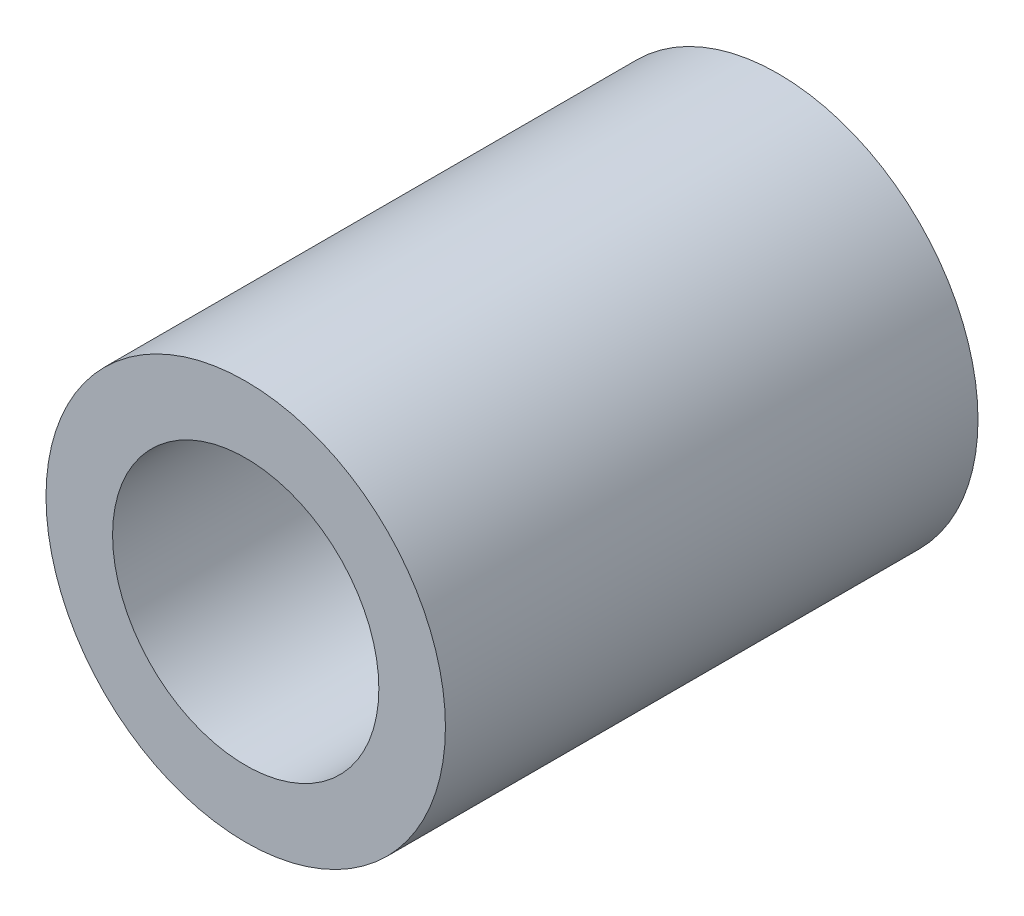
ISO-10303-21;
HEADER;
FILE_DESCRIPTION(('STEP AP214'),'2;1');
FILE_NAME('part.step','',(''),(''),'','','');
FILE_SCHEMA(('AUTOMOTIVE_DESIGN { 1 0 10303 214 1 1 1 1 }'));
ENDSEC;
DATA;
#1=APPLICATION_CONTEXT('core data for automotive mechanical design processes');
#2=APPLICATION_PROTOCOL_DEFINITION('international standard','automotive_design',2000,#1);
#3=PRODUCT_CONTEXT('',#1,'mechanical');
#4=PRODUCT('Part','Part','',(#3));
#5=PRODUCT_RELATED_PRODUCT_CATEGORY('part','',(#4));
#6=PRODUCT_DEFINITION_FORMATION('','',#4);
#7=PRODUCT_DEFINITION_CONTEXT('part definition',#1,'design');
#8=PRODUCT_DEFINITION('design','',#6,#7);
#9=PRODUCT_DEFINITION_SHAPE('','',#8);
#10=(LENGTH_UNIT() NAMED_UNIT(*) SI_UNIT(.MILLI.,.METRE.));
#11=(NAMED_UNIT(*) PLANE_ANGLE_UNIT() SI_UNIT($,.RADIAN.));
#12=(NAMED_UNIT(*) SI_UNIT($,.STERADIAN.) SOLID_ANGLE_UNIT());
#13=UNCERTAINTY_MEASURE_WITH_UNIT(LENGTH_MEASURE(1.E-05),#10,'distance_accuracy_value','');
#14=(GEOMETRIC_REPRESENTATION_CONTEXT(3) GLOBAL_UNCERTAINTY_ASSIGNED_CONTEXT((#13)) GLOBAL_UNIT_ASSIGNED_CONTEXT((#10,
#11,#12)) REPRESENTATION_CONTEXT('',''));
#15=CARTESIAN_POINT('',(0.,0.,0.));
#16=DIRECTION('',(0.,0.,1.));
#17=DIRECTION('',(1.,0.,0.));
#18=AXIS2_PLACEMENT_3D('',#15,#16,#17);
#19=CARTESIAN_POINT('',(0.,0.,12.7));
#20=DIRECTION('',(0.,0.,1.));
#21=DIRECTION('',(1.,0.,0.));
#22=AXIS2_PLACEMENT_3D('',#19,#20,#21);
#23=PLANE('',#22);
#24=CARTESIAN_POINT('',(0.,0.,12.7));
#25=DIRECTION('',(0.,0.,1.));
#26=DIRECTION('',(1.,0.,0.));
#27=AXIS2_PLACEMENT_3D('',#24,#25,#26);
#28=CIRCLE('',#27,4.7625);
#29=CARTESIAN_POINT('',(4.7625,0.,12.7));
#30=VERTEX_POINT('',#29);
#31=EDGE_CURVE('E10',#30,#30,#28,.T.);
#32=ORIENTED_EDGE('',*,*,#31,.T.);
#33=EDGE_LOOP('',(#32));
#34=FACE_BOUND('',#33,.T.);
#35=CARTESIAN_POINT('',(0.,0.,12.7));
#36=DIRECTION('',(0.,0.,1.));
#37=DIRECTION('',(1.,0.,0.));
#38=AXIS2_PLACEMENT_3D('',#35,#36,#37);
#39=CIRCLE('',#38,3.175);
#40=CARTESIAN_POINT('',(3.175,0.,12.7));
#41=VERTEX_POINT('',#40);
#42=EDGE_CURVE('E44',#41,#41,#39,.T.);
#43=ORIENTED_EDGE('',*,*,#42,.F.);
#44=EDGE_LOOP('',(#43));
#45=FACE_BOUND('',#44,.T.);
#46=ADVANCED_FACE('F32',(#34,#45),#23,.T.);
#47=CARTESIAN_POINT('',(0.,0.,0.));
#48=DIRECTION('',(0.,0.,1.));
#49=DIRECTION('',(1.,0.,0.));
#50=AXIS2_PLACEMENT_3D('',#47,#48,#49);
#51=PLANE('',#50);
#52=CARTESIAN_POINT('',(0.,0.,0.));
#53=DIRECTION('',(0.,0.,1.));
#54=DIRECTION('',(1.,0.,0.));
#55=AXIS2_PLACEMENT_3D('',#52,#53,#54);
#56=CIRCLE('',#55,4.7625);
#57=CARTESIAN_POINT('',(4.7625,0.,0.));
#58=VERTEX_POINT('',#57);
#59=EDGE_CURVE('E36',#58,#58,#56,.T.);
#60=ORIENTED_EDGE('',*,*,#59,.F.);
#61=EDGE_LOOP('',(#60));
#62=FACE_BOUND('',#61,.T.);
#63=CARTESIAN_POINT('',(0.,0.,0.));
#64=DIRECTION('',(0.,0.,1.));
#65=DIRECTION('',(1.,0.,0.));
#66=AXIS2_PLACEMENT_3D('',#63,#64,#65);
#67=CIRCLE('',#66,3.175);
#68=CARTESIAN_POINT('',(3.175,0.,0.));
#69=VERTEX_POINT('',#68);
#70=EDGE_CURVE('E46',#69,#69,#67,.T.);
#71=ORIENTED_EDGE('',*,*,#70,.T.);
#72=EDGE_LOOP('',(#71));
#73=FACE_BOUND('',#72,.T.);
#74=ADVANCED_FACE('F57',(#62,#73),#51,.F.);
#75=CARTESIAN_POINT('',(0.,0.,12.7));
#76=DIRECTION('',(0.,0.,-1.));
#77=DIRECTION('',(-1.,0.,0.));
#78=AXIS2_PLACEMENT_3D('',#75,#76,#77);
#79=CYLINDRICAL_SURFACE('',#78,4.7625);
#80=ORIENTED_EDGE('',*,*,#31,.F.);
#81=EDGE_LOOP('',(#80));
#82=FACE_BOUND('',#81,.T.);
#83=ORIENTED_EDGE('',*,*,#59,.T.);
#84=EDGE_LOOP('',(#83));
#85=FACE_BOUND('',#84,.T.);
#86=ADVANCED_FACE('F34',(#82,#85),#79,.T.);
#87=CARTESIAN_POINT('',(0.,0.,12.7));
#88=DIRECTION('',(0.,0.,-1.));
#89=DIRECTION('',(-1.,0.,0.));
#90=AXIS2_PLACEMENT_3D('',#87,#88,#89);
#91=CYLINDRICAL_SURFACE('',#90,3.175);
#92=ORIENTED_EDGE('',*,*,#42,.T.);
#93=EDGE_LOOP('',(#92));
#94=FACE_BOUND('',#93,.T.);
#95=ORIENTED_EDGE('',*,*,#70,.F.);
#96=EDGE_LOOP('',(#95));
#97=FACE_BOUND('',#96,.T.);
#98=ADVANCED_FACE('F53',(#94,#97),#91,.F.);
#99=CLOSED_SHELL('',(#46,#74,#86,#98));
#100=MANIFOLD_SOLID_BREP('B2',#99);
#101=ADVANCED_BREP_SHAPE_REPRESENTATION('',(#18,#100),#14);
#102=SHAPE_DEFINITION_REPRESENTATION(#9,#101);
ENDSEC;
END-ISO-10303-21;
